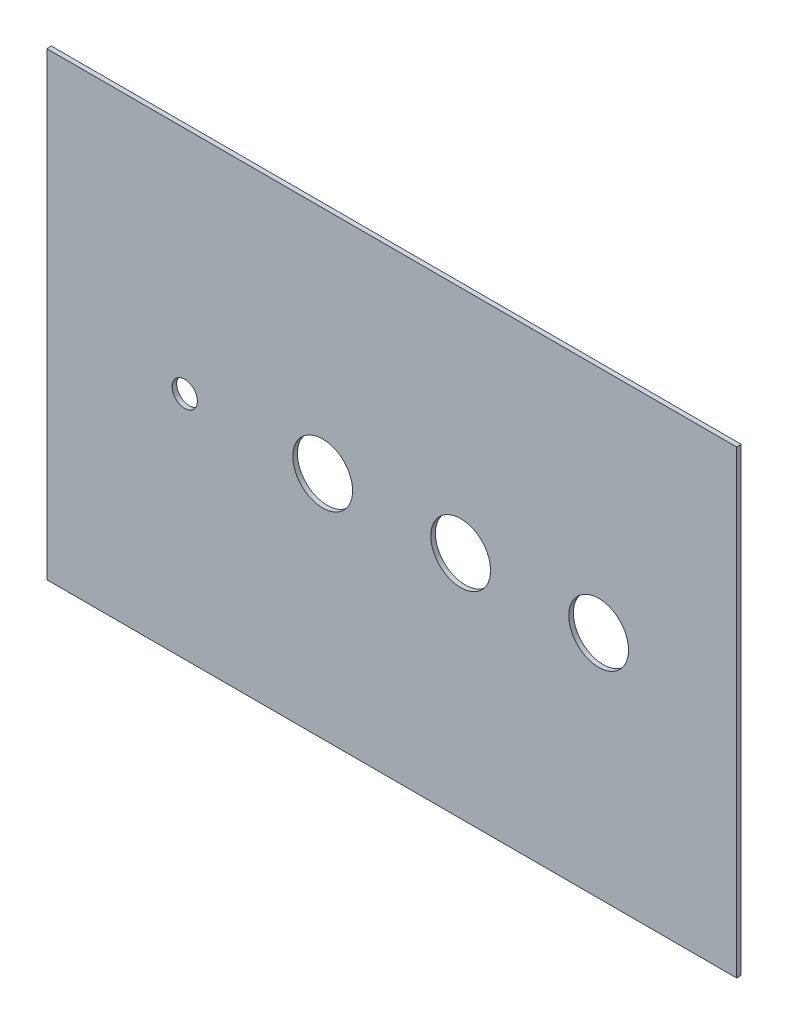
ISO-10303-21;
HEADER;
FILE_DESCRIPTION(('STEP AP214'),'2;1');
FILE_NAME('part.step','',(''),(''),'','','');
FILE_SCHEMA(('AUTOMOTIVE_DESIGN { 1 0 10303 214 1 1 1 1 }'));
ENDSEC;
DATA;
#1=APPLICATION_CONTEXT('core data for automotive mechanical design processes');
#2=APPLICATION_PROTOCOL_DEFINITION('international standard','automotive_design',2000,#1);
#3=PRODUCT_CONTEXT('',#1,'mechanical');
#4=PRODUCT('Part','Part','',(#3));
#5=PRODUCT_RELATED_PRODUCT_CATEGORY('part','',(#4));
#6=PRODUCT_DEFINITION_FORMATION('','',#4);
#7=PRODUCT_DEFINITION_CONTEXT('part definition',#1,'design');
#8=PRODUCT_DEFINITION('design','',#6,#7);
#9=PRODUCT_DEFINITION_SHAPE('','',#8);
#10=(LENGTH_UNIT() NAMED_UNIT(*) SI_UNIT(.MILLI.,.METRE.));
#11=(NAMED_UNIT(*) PLANE_ANGLE_UNIT() SI_UNIT($,.RADIAN.));
#12=(NAMED_UNIT(*) SI_UNIT($,.STERADIAN.) SOLID_ANGLE_UNIT());
#13=UNCERTAINTY_MEASURE_WITH_UNIT(LENGTH_MEASURE(1.E-05),#10,'distance_accuracy_value','');
#14=(GEOMETRIC_REPRESENTATION_CONTEXT(3) GLOBAL_UNCERTAINTY_ASSIGNED_CONTEXT((#13)) GLOBAL_UNIT_ASSIGNED_CONTEXT((#10,
#11,#12)) REPRESENTATION_CONTEXT('',''));
#15=CARTESIAN_POINT('',(0.,0.,0.));
#16=DIRECTION('',(0.,0.,1.));
#17=DIRECTION('',(1.,0.,0.));
#18=AXIS2_PLACEMENT_3D('',#15,#16,#17);
#19=CARTESIAN_POINT('',(0.,0.,2.));
#20=DIRECTION('',(0.,0.,-1.));
#21=DIRECTION('',(-1.00000000000002,0.,0.));
#22=AXIS2_PLACEMENT_3D('',#19,#20,#21);
#23=PLANE('',#22);
#24=DIRECTION('',(0.,-1.,0.));
#25=VECTOR('',#24,1.);
#26=CARTESIAN_POINT('',(-150.000000000006,100.,2.));
#27=LINE('',#26,#25);
#28=CARTESIAN_POINT('',(-150.000000000006,100.,2.));
#29=VERTEX_POINT('',#28);
#30=CARTESIAN_POINT('',(-150.000000000006,-99.9999999999999,2.));
#31=VERTEX_POINT('',#30);
#32=EDGE_CURVE('E84',#29,#31,#27,.T.);
#33=ORIENTED_EDGE('',*,*,#32,.T.);
#34=DIRECTION('',(1.00000000000002,0.,0.));
#35=VECTOR('',#34,1.);
#36=CARTESIAN_POINT('',(150.000000000002,-99.999999999995,2.));
#37=LINE('',#36,#35);
#38=CARTESIAN_POINT('',(150.000000000002,-99.999999999995,2.));
#39=VERTEX_POINT('',#38);
#40=EDGE_CURVE('E79',#31,#39,#37,.T.);
#41=ORIENTED_EDGE('',*,*,#40,.T.);
#42=DIRECTION('',(0.,1.,0.));
#43=VECTOR('',#42,1.);
#44=CARTESIAN_POINT('',(150.000000000003,100.000000000005,2.));
#45=LINE('',#44,#43);
#46=CARTESIAN_POINT('',(150.000000000003,100.000000000005,2.));
#47=VERTEX_POINT('',#46);
#48=EDGE_CURVE('E82',#39,#47,#45,.T.);
#49=ORIENTED_EDGE('',*,*,#48,.T.);
#50=DIRECTION('',(-1.00000000000002,0.,0.));
#51=VECTOR('',#50,1.);
#52=CARTESIAN_POINT('',(150.000000000003,100.000000000005,2.));
#53=LINE('',#52,#51);
#54=EDGE_CURVE('E49',#47,#29,#53,.T.);
#55=ORIENTED_EDGE('',*,*,#54,.T.);
#56=EDGE_LOOP('',(#33,#41,#49,#55));
#57=FACE_BOUND('',#56,.T.);
#58=CARTESIAN_POINT('',(29.9999999999987,5.10702591327572E-12,2.));
#59=DIRECTION('',(0.,0.,1.));
#60=DIRECTION('',(1.00000000000002,0.,0.));
#61=AXIS2_PLACEMENT_3D('',#58,#59,#60);
#62=CIRCLE('',#61,13.);
#63=CARTESIAN_POINT('',(42.999999999999,5.10702591327572E-12,2.00000000000012));
#64=VERTEX_POINT('',#63);
#65=EDGE_CURVE('E99',#64,#64,#62,.T.);
#66=ORIENTED_EDGE('',*,*,#65,.F.);
#67=EDGE_LOOP('',(#66));
#68=FACE_BOUND('',#67,.T.);
#69=CARTESIAN_POINT('',(90.0000000000004,5.10702591327572E-12,2.));
#70=DIRECTION('',(0.,0.,1.));
#71=DIRECTION('',(1.00000000000002,0.,0.));
#72=AXIS2_PLACEMENT_3D('',#69,#70,#71);
#73=CIRCLE('',#72,13.);
#74=CARTESIAN_POINT('',(103.000000000001,5.10702591327572E-12,2.00000000000012));
#75=VERTEX_POINT('',#74);
#76=EDGE_CURVE('E114',#75,#75,#73,.T.);
#77=ORIENTED_EDGE('',*,*,#76,.F.);
#78=EDGE_LOOP('',(#77));
#79=FACE_BOUND('',#78,.T.);
#80=CARTESIAN_POINT('',(-30.,0.,2.));
#81=DIRECTION('',(0.,0.,1.));
#82=DIRECTION('',(1.00000000000002,0.,0.));
#83=AXIS2_PLACEMENT_3D('',#80,#81,#82);
#84=CIRCLE('',#83,13.);
#85=CARTESIAN_POINT('',(-16.9999999999997,0.,2.00000000000012));
#86=VERTEX_POINT('',#85);
#87=EDGE_CURVE('E120',#86,#86,#84,.T.);
#88=ORIENTED_EDGE('',*,*,#87,.F.);
#89=EDGE_LOOP('',(#88));
#90=FACE_BOUND('',#89,.T.);
#91=CARTESIAN_POINT('',(-90.0000000000001,0.,2.));
#92=DIRECTION('',(0.,0.,1.));
#93=DIRECTION('',(1.00000000000002,0.,0.));
#94=AXIS2_PLACEMENT_3D('',#91,#92,#93);
#95=CIRCLE('',#94,5.5);
#96=CARTESIAN_POINT('',(-84.4999999999999,0.,2.00000000000005));
#97=VERTEX_POINT('',#96);
#98=EDGE_CURVE('E126',#97,#97,#95,.T.);
#99=ORIENTED_EDGE('',*,*,#98,.F.);
#100=EDGE_LOOP('',(#99));
#101=FACE_BOUND('',#100,.T.);
#102=ADVANCED_FACE('F32',(#57,#68,#79,#90,#101),#23,.F.);
#103=CARTESIAN_POINT('',(0.,0.,0.));
#104=DIRECTION('',(0.,0.,-1.));
#105=DIRECTION('',(-1.00000000000002,0.,0.));
#106=AXIS2_PLACEMENT_3D('',#103,#104,#105);
#107=PLANE('',#106);
#108=CARTESIAN_POINT('',(-30.,0.,0.));
#109=DIRECTION('',(0.,0.,1.));
#110=DIRECTION('',(1.00000000000002,0.,0.));
#111=AXIS2_PLACEMENT_3D('',#108,#109,#110);
#112=CIRCLE('',#111,13.);
#113=CARTESIAN_POINT('',(-16.9999999999997,0.,1.14741549595011E-13));
#114=VERTEX_POINT('',#113);
#115=EDGE_CURVE('E123',#114,#114,#112,.T.);
#116=ORIENTED_EDGE('',*,*,#115,.T.);
#117=EDGE_LOOP('',(#116));
#118=FACE_BOUND('',#117,.T.);
#119=CARTESIAN_POINT('',(29.9999999999987,5.10702591327572E-12,0.));
#120=DIRECTION('',(0.,0.,1.));
#121=DIRECTION('',(1.00000000000002,0.,0.));
#122=AXIS2_PLACEMENT_3D('',#119,#120,#121);
#123=CIRCLE('',#122,13.);
#124=CARTESIAN_POINT('',(42.999999999999,5.10702591327572E-12,1.14741549595011E-13));
#125=VERTEX_POINT('',#124);
#126=EDGE_CURVE('E111',#125,#125,#123,.T.);
#127=ORIENTED_EDGE('',*,*,#126,.T.);
#128=EDGE_LOOP('',(#127));
#129=FACE_BOUND('',#128,.T.);
#130=DIRECTION('',(0.,-1.,0.));
#131=VECTOR('',#130,1.);
#132=CARTESIAN_POINT('',(-150.000000000006,100.,0.));
#133=LINE('',#132,#131);
#134=CARTESIAN_POINT('',(-150.000000000006,100.,0.));
#135=VERTEX_POINT('',#134);
#136=CARTESIAN_POINT('',(-150.000000000006,-99.9999999999999,0.));
#137=VERTEX_POINT('',#136);
#138=EDGE_CURVE('E96',#135,#137,#133,.T.);
#139=ORIENTED_EDGE('',*,*,#138,.F.);
#140=DIRECTION('',(-1.00000000000002,0.,0.));
#141=VECTOR('',#140,1.);
#142=CARTESIAN_POINT('',(150.000000000003,100.000000000005,0.));
#143=LINE('',#142,#141);
#144=CARTESIAN_POINT('',(150.000000000003,100.000000000005,0.));
#145=VERTEX_POINT('',#144);
#146=EDGE_CURVE('E72',#145,#135,#143,.T.);
#147=ORIENTED_EDGE('',*,*,#146,.F.);
#148=DIRECTION('',(0.,1.,0.));
#149=VECTOR('',#148,1.);
#150=CARTESIAN_POINT('',(150.000000000003,100.000000000005,0.));
#151=LINE('',#150,#149);
#152=CARTESIAN_POINT('',(150.000000000002,-99.999999999995,0.));
#153=VERTEX_POINT('',#152);
#154=EDGE_CURVE('E66',#153,#145,#151,.T.);
#155=ORIENTED_EDGE('',*,*,#154,.F.);
#156=DIRECTION('',(1.00000000000002,0.,0.));
#157=VECTOR('',#156,1.);
#158=CARTESIAN_POINT('',(150.000000000002,-99.999999999995,0.));
#159=LINE('',#158,#157);
#160=EDGE_CURVE('E88',#137,#153,#159,.T.);
#161=ORIENTED_EDGE('',*,*,#160,.F.);
#162=EDGE_LOOP('',(#139,#147,#155,#161));
#163=FACE_BOUND('',#162,.T.);
#164=CARTESIAN_POINT('',(90.0000000000004,5.10702591327572E-12,0.));
#165=DIRECTION('',(0.,0.,1.));
#166=DIRECTION('',(1.00000000000002,0.,0.));
#167=AXIS2_PLACEMENT_3D('',#164,#165,#166);
#168=CIRCLE('',#167,13.);
#169=CARTESIAN_POINT('',(103.000000000001,5.10702591327572E-12,1.14741549595011E-13));
#170=VERTEX_POINT('',#169);
#171=EDGE_CURVE('E117',#170,#170,#168,.T.);
#172=ORIENTED_EDGE('',*,*,#171,.T.);
#173=EDGE_LOOP('',(#172));
#174=FACE_BOUND('',#173,.T.);
#175=CARTESIAN_POINT('',(-90.0000000000001,0.,0.));
#176=DIRECTION('',(0.,0.,1.));
#177=DIRECTION('',(1.00000000000002,0.,0.));
#178=AXIS2_PLACEMENT_3D('',#175,#176,#177);
#179=CIRCLE('',#178,5.5);
#180=CARTESIAN_POINT('',(-84.4999999999999,0.,0.));
#181=VERTEX_POINT('',#180);
#182=EDGE_CURVE('E129',#181,#181,#179,.T.);
#183=ORIENTED_EDGE('',*,*,#182,.T.);
#184=EDGE_LOOP('',(#183));
#185=FACE_BOUND('',#184,.T.);
#186=ADVANCED_FACE('F107',(#118,#129,#163,#174,#185),#107,.T.);
#187=CARTESIAN_POINT('',(-150.000000000006,100.,2.));
#188=DIRECTION('',(1.00000000000002,0.,0.));
#189=DIRECTION('',(0.,1.,0.));
#190=AXIS2_PLACEMENT_3D('',#187,#188,#189);
#191=PLANE('',#190);
#192=ORIENTED_EDGE('',*,*,#138,.T.);
#193=DIRECTION('',(0.,0.,-1.));
#194=VECTOR('',#193,1.);
#195=CARTESIAN_POINT('',(-150.000000000006,-99.9999999999999,2.));
#196=LINE('',#195,#194);
#197=EDGE_CURVE('E11',#31,#137,#196,.T.);
#198=ORIENTED_EDGE('',*,*,#197,.F.);
#199=ORIENTED_EDGE('',*,*,#32,.F.);
#200=DIRECTION('',(0.,0.,-1.));
#201=VECTOR('',#200,1.);
#202=CARTESIAN_POINT('',(-150.000000000006,100.,2.));
#203=LINE('',#202,#201);
#204=EDGE_CURVE('E92',#29,#135,#203,.T.);
#205=ORIENTED_EDGE('',*,*,#204,.T.);
#206=EDGE_LOOP('',(#192,#198,#199,#205));
#207=FACE_BOUND('',#206,.T.);
#208=ADVANCED_FACE('F34',(#207),#191,.F.);
#209=CARTESIAN_POINT('',(150.000000000002,-99.999999999995,2.));
#210=DIRECTION('',(0.,1.,0.));
#211=DIRECTION('',(0.,0.,1.));
#212=AXIS2_PLACEMENT_3D('',#209,#210,#211);
#213=PLANE('',#212);
#214=ORIENTED_EDGE('',*,*,#160,.T.);
#215=DIRECTION('',(0.,0.,-1.));
#216=VECTOR('',#215,1.);
#217=CARTESIAN_POINT('',(150.000000000002,-99.999999999995,2.));
#218=LINE('',#217,#216);
#219=EDGE_CURVE('E41',#39,#153,#218,.T.);
#220=ORIENTED_EDGE('',*,*,#219,.F.);
#221=ORIENTED_EDGE('',*,*,#40,.F.);
#222=ORIENTED_EDGE('',*,*,#197,.T.);
#223=EDGE_LOOP('',(#214,#220,#221,#222));
#224=FACE_BOUND('',#223,.T.);
#225=ADVANCED_FACE('F87',(#224),#213,.F.);
#226=CARTESIAN_POINT('',(150.000000000003,100.000000000005,2.));
#227=DIRECTION('',(-1.00000000000002,0.,0.));
#228=DIRECTION('',(0.,0.,1.));
#229=AXIS2_PLACEMENT_3D('',#226,#227,#228);
#230=PLANE('',#229);
#231=ORIENTED_EDGE('',*,*,#154,.T.);
#232=DIRECTION('',(0.,0.,-1.));
#233=VECTOR('',#232,1.);
#234=CARTESIAN_POINT('',(150.000000000003,100.000000000005,2.));
#235=LINE('',#234,#233);
#236=EDGE_CURVE('E89',#47,#145,#235,.T.);
#237=ORIENTED_EDGE('',*,*,#236,.F.);
#238=ORIENTED_EDGE('',*,*,#48,.F.);
#239=ORIENTED_EDGE('',*,*,#219,.T.);
#240=EDGE_LOOP('',(#231,#237,#238,#239));
#241=FACE_BOUND('',#240,.T.);
#242=ADVANCED_FACE('F90',(#241),#230,.F.);
#243=CARTESIAN_POINT('',(150.000000000003,100.000000000005,2.));
#244=DIRECTION('',(0.,-1.,0.));
#245=DIRECTION('',(1.00000000000002,0.,0.));
#246=AXIS2_PLACEMENT_3D('',#243,#244,#245);
#247=PLANE('',#246);
#248=ORIENTED_EDGE('',*,*,#146,.T.);
#249=ORIENTED_EDGE('',*,*,#204,.F.);
#250=ORIENTED_EDGE('',*,*,#54,.F.);
#251=ORIENTED_EDGE('',*,*,#236,.T.);
#252=EDGE_LOOP('',(#248,#249,#250,#251));
#253=FACE_BOUND('',#252,.T.);
#254=ADVANCED_FACE('F104',(#253),#247,.F.);
#255=CARTESIAN_POINT('',(29.9999999999987,5.10702591327572E-12,2.));
#256=DIRECTION('',(0.,0.,-1.));
#257=DIRECTION('',(-1.00000000000002,0.,0.));
#258=AXIS2_PLACEMENT_3D('',#255,#256,#257);
#259=CYLINDRICAL_SURFACE('',#258,13.);
#260=ORIENTED_EDGE('',*,*,#65,.T.);
#261=EDGE_LOOP('',(#260));
#262=FACE_BOUND('',#261,.T.);
#263=ORIENTED_EDGE('',*,*,#126,.F.);
#264=EDGE_LOOP('',(#263));
#265=FACE_BOUND('',#264,.T.);
#266=ADVANCED_FACE('F146',(#262,#265),#259,.F.);
#267=CARTESIAN_POINT('',(90.0000000000004,5.10702591327572E-12,2.));
#268=DIRECTION('',(0.,0.,-1.));
#269=DIRECTION('',(-1.00000000000002,0.,0.));
#270=AXIS2_PLACEMENT_3D('',#267,#268,#269);
#271=CYLINDRICAL_SURFACE('',#270,13.);
#272=ORIENTED_EDGE('',*,*,#76,.T.);
#273=EDGE_LOOP('',(#272));
#274=FACE_BOUND('',#273,.T.);
#275=ORIENTED_EDGE('',*,*,#171,.F.);
#276=EDGE_LOOP('',(#275));
#277=FACE_BOUND('',#276,.T.);
#278=ADVANCED_FACE('F192',(#274,#277),#271,.F.);
#279=CARTESIAN_POINT('',(-30.,0.,2.));
#280=DIRECTION('',(0.,0.,-1.));
#281=DIRECTION('',(-1.00000000000002,0.,0.));
#282=AXIS2_PLACEMENT_3D('',#279,#280,#281);
#283=CYLINDRICAL_SURFACE('',#282,13.);
#284=ORIENTED_EDGE('',*,*,#87,.T.);
#285=EDGE_LOOP('',(#284));
#286=FACE_BOUND('',#285,.T.);
#287=ORIENTED_EDGE('',*,*,#115,.F.);
#288=EDGE_LOOP('',(#287));
#289=FACE_BOUND('',#288,.T.);
#290=ADVANCED_FACE('F200',(#286,#289),#283,.F.);
#291=CARTESIAN_POINT('',(-90.0000000000001,0.,2.));
#292=DIRECTION('',(0.,0.,-1.));
#293=DIRECTION('',(-1.00000000000002,0.,0.));
#294=AXIS2_PLACEMENT_3D('',#291,#292,#293);
#295=CYLINDRICAL_SURFACE('',#294,5.5);
#296=ORIENTED_EDGE('',*,*,#98,.T.);
#297=EDGE_LOOP('',(#296));
#298=FACE_BOUND('',#297,.T.);
#299=ORIENTED_EDGE('',*,*,#182,.F.);
#300=EDGE_LOOP('',(#299));
#301=FACE_BOUND('',#300,.T.);
#302=ADVANCED_FACE('F135',(#298,#301),#295,.F.);
#303=CLOSED_SHELL('',(#102,#186,#208,#225,#242,#254,#266,#278,#290,#302));
#304=MANIFOLD_SOLID_BREP('B2',#303);
#305=ADVANCED_BREP_SHAPE_REPRESENTATION('',(#18,#304),#14);
#306=SHAPE_DEFINITION_REPRESENTATION(#9,#305);
ENDSEC;
END-ISO-10303-21;
